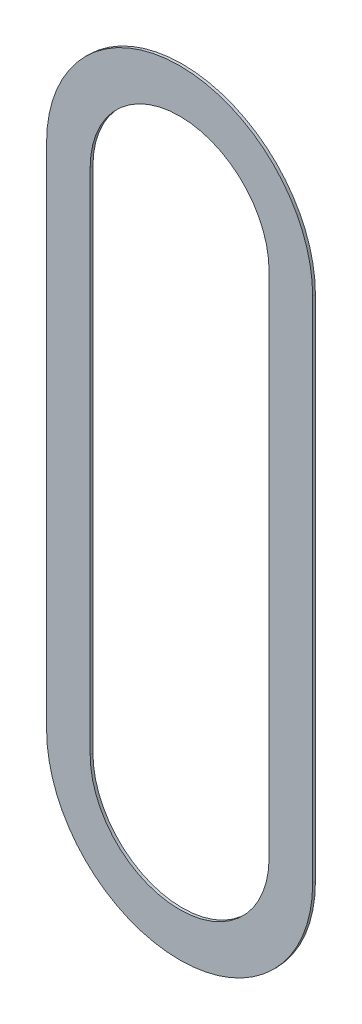
ISO-10303-21;
HEADER;
FILE_DESCRIPTION(('STEP AP214'),'2;1');
FILE_NAME('part.step','',(''),(''),'','','');
FILE_SCHEMA(('AUTOMOTIVE_DESIGN { 1 0 10303 214 1 1 1 1 }'));
ENDSEC;
DATA;
#1=APPLICATION_CONTEXT('core data for automotive mechanical design processes');
#2=APPLICATION_PROTOCOL_DEFINITION('international standard','automotive_design',2000,#1);
#3=PRODUCT_CONTEXT('',#1,'mechanical');
#4=PRODUCT('Part','Part','',(#3));
#5=PRODUCT_RELATED_PRODUCT_CATEGORY('part','',(#4));
#6=PRODUCT_DEFINITION_FORMATION('','',#4);
#7=PRODUCT_DEFINITION_CONTEXT('part definition',#1,'design');
#8=PRODUCT_DEFINITION('design','',#6,#7);
#9=PRODUCT_DEFINITION_SHAPE('','',#8);
#10=(LENGTH_UNIT() NAMED_UNIT(*) SI_UNIT(.MILLI.,.METRE.));
#11=(NAMED_UNIT(*) PLANE_ANGLE_UNIT() SI_UNIT($,.RADIAN.));
#12=(NAMED_UNIT(*) SI_UNIT($,.STERADIAN.) SOLID_ANGLE_UNIT());
#13=UNCERTAINTY_MEASURE_WITH_UNIT(LENGTH_MEASURE(1.E-05),#10,'distance_accuracy_value','');
#14=(GEOMETRIC_REPRESENTATION_CONTEXT(3) GLOBAL_UNCERTAINTY_ASSIGNED_CONTEXT((#13)) GLOBAL_UNIT_ASSIGNED_CONTEXT((#10,
#11,#12)) REPRESENTATION_CONTEXT('',''));
#15=CARTESIAN_POINT('',(0.,0.,0.));
#16=DIRECTION('',(0.,0.,1.));
#17=DIRECTION('',(1.,0.,0.));
#18=AXIS2_PLACEMENT_3D('',#15,#16,#17);
#19=CARTESIAN_POINT('',(16.5805785526266,2.38584342868797,0.));
#20=DIRECTION('',(0.,0.,-1.));
#21=DIRECTION('',(0.,-1.,0.));
#22=AXIS2_PLACEMENT_3D('',#19,#20,#21);
#23=PLANE('',#22);
#24=CARTESIAN_POINT('',(16.5805785526263,1.9248653543712,0.));
#25=DIRECTION('',(0.,0.,1.));
#26=DIRECTION('',(1.,0.,0.));
#27=AXIS2_PLACEMENT_3D('',#24,#25,#26);
#28=CIRCLE('',#27,0.162223011351486);
#29=CARTESIAN_POINT('',(16.4183555412749,1.9248653543712,0.));
#30=VERTEX_POINT('',#29);
#31=CARTESIAN_POINT('',(16.7428015639778,1.9248653543712,0.));
#32=VERTEX_POINT('',#31);
#33=EDGE_CURVE('E82',#30,#32,#28,.T.);
#34=ORIENTED_EDGE('',*,*,#33,.F.);
#35=DIRECTION('',(0.,-1.,0.));
#36=VECTOR('',#35,1.);
#37=CARTESIAN_POINT('',(16.4183555412749,1.9248653543712,0.));
#38=LINE('',#37,#36);
#39=CARTESIAN_POINT('',(16.4183555412749,2.84682150300628,0.));
#40=VERTEX_POINT('',#39);
#41=EDGE_CURVE('E150',#40,#30,#38,.T.);
#42=ORIENTED_EDGE('',*,*,#41,.F.);
#43=CARTESIAN_POINT('',(16.5805785526263,2.84682150300628,0.));
#44=DIRECTION('',(0.,0.,1.));
#45=DIRECTION('',(-1.,0.,0.));
#46=AXIS2_PLACEMENT_3D('',#43,#44,#45);
#47=CIRCLE('',#46,0.162223011351486);
#48=CARTESIAN_POINT('',(16.7428015639778,2.84682150300628,0.));
#49=VERTEX_POINT('',#48);
#50=EDGE_CURVE('E131',#49,#40,#47,.T.);
#51=ORIENTED_EDGE('',*,*,#50,.F.);
#52=DIRECTION('',(0.,1.,0.));
#53=VECTOR('',#52,1.);
#54=CARTESIAN_POINT('',(16.7428015639778,2.84682150300628,0.));
#55=LINE('',#54,#53);
#56=EDGE_CURVE('E117',#32,#49,#55,.T.);
#57=ORIENTED_EDGE('',*,*,#56,.F.);
#58=EDGE_LOOP('',(#34,#42,#51,#57));
#59=FACE_BOUND('',#58,.T.);
#60=CARTESIAN_POINT('',(16.5805785526269,1.9248653543712,0.));
#61=DIRECTION('',(0.,0.,-1.));
#62=DIRECTION('',(1.,1.64619282766669E-12,0.));
#63=AXIS2_PLACEMENT_3D('',#60,#61,#62);
#64=CIRCLE('',#63,0.241273245991853);
#65=CARTESIAN_POINT('',(16.8218517986187,1.92486535437159,0.));
#66=VERTEX_POINT('',#65);
#67=CARTESIAN_POINT('',(16.339305306635,1.9248653543708,0.));
#68=VERTEX_POINT('',#67);
#69=EDGE_CURVE('E21',#66,#68,#64,.T.);
#70=ORIENTED_EDGE('',*,*,#69,.F.);
#71=DIRECTION('',(2.23018529097051E-12,-1.,0.));
#72=VECTOR('',#71,1.);
#73=CARTESIAN_POINT('',(16.8218517986167,2.84682150300668,0.));
#74=LINE('',#73,#72);
#75=CARTESIAN_POINT('',(16.8218517986167,2.84682150300668,0.));
#76=VERTEX_POINT('',#75);
#77=EDGE_CURVE('E151',#76,#66,#74,.T.);
#78=ORIENTED_EDGE('',*,*,#77,.F.);
#79=CARTESIAN_POINT('',(16.5805785526263,2.84682150300628,0.));
#80=DIRECTION('',(0.,0.,-1.));
#81=DIRECTION('',(-1.,1.64734320701166E-12,0.));
#82=AXIS2_PLACEMENT_3D('',#79,#80,#81);
#83=CIRCLE('',#82,0.241273245990319);
#84=CARTESIAN_POINT('',(16.339305306636,2.84682150300668,0.));
#85=VERTEX_POINT('',#84);
#86=EDGE_CURVE('E142',#85,#76,#83,.T.);
#87=ORIENTED_EDGE('',*,*,#86,.F.);
#88=DIRECTION('',(1.67143476450706E-12,1.,0.));
#89=VECTOR('',#88,1.);
#90=CARTESIAN_POINT('',(16.3393053066345,1.92486535437159,0.));
#91=LINE('',#90,#89);
#92=EDGE_CURVE('E158',#68,#85,#91,.T.);
#93=ORIENTED_EDGE('',*,*,#92,.F.);
#94=EDGE_LOOP('',(#70,#78,#87,#93));
#95=FACE_BOUND('',#94,.T.);
#96=ADVANCED_FACE('F17',(#59,#95),#23,.F.);
#97=CARTESIAN_POINT('',(16.5805785526266,2.38584342868797,-0.005));
#98=DIRECTION('',(0.,0.,-1.));
#99=DIRECTION('',(0.,-1.,0.));
#100=AXIS2_PLACEMENT_3D('',#97,#98,#99);
#101=PLANE('',#100);
#102=CARTESIAN_POINT('',(16.5805785526263,1.9248653543712,-0.005));
#103=DIRECTION('',(0.,0.,1.));
#104=DIRECTION('',(1.,0.,0.));
#105=AXIS2_PLACEMENT_3D('',#102,#103,#104);
#106=CIRCLE('',#105,0.162223011351486);
#107=CARTESIAN_POINT('',(16.4183555412749,1.9248653543712,-0.005));
#108=VERTEX_POINT('',#107);
#109=CARTESIAN_POINT('',(16.7428015639778,1.9248653543712,-0.005));
#110=VERTEX_POINT('',#109);
#111=EDGE_CURVE('E70',#108,#110,#106,.T.);
#112=ORIENTED_EDGE('',*,*,#111,.T.);
#113=DIRECTION('',(0.,1.,0.));
#114=VECTOR('',#113,1.);
#115=CARTESIAN_POINT('',(16.7428015639778,2.84682150300628,-0.005));
#116=LINE('',#115,#114);
#117=CARTESIAN_POINT('',(16.7428015639778,2.84682150300628,-0.005));
#118=VERTEX_POINT('',#117);
#119=EDGE_CURVE('E107',#110,#118,#116,.T.);
#120=ORIENTED_EDGE('',*,*,#119,.T.);
#121=CARTESIAN_POINT('',(16.5805785526263,2.84682150300628,-0.005));
#122=DIRECTION('',(0.,0.,1.));
#123=DIRECTION('',(-1.,0.,0.));
#124=AXIS2_PLACEMENT_3D('',#121,#122,#123);
#125=CIRCLE('',#124,0.162223011351486);
#126=CARTESIAN_POINT('',(16.4183555412749,2.84682150300628,-0.005));
#127=VERTEX_POINT('',#126);
#128=EDGE_CURVE('E111',#118,#127,#125,.T.);
#129=ORIENTED_EDGE('',*,*,#128,.T.);
#130=DIRECTION('',(0.,-1.,0.));
#131=VECTOR('',#130,1.);
#132=CARTESIAN_POINT('',(16.4183555412749,1.9248653543712,-0.005));
#133=LINE('',#132,#131);
#134=EDGE_CURVE('E140',#127,#108,#133,.T.);
#135=ORIENTED_EDGE('',*,*,#134,.T.);
#136=EDGE_LOOP('',(#112,#120,#129,#135));
#137=FACE_BOUND('',#136,.T.);
#138=CARTESIAN_POINT('',(16.5805785526269,1.9248653543712,-0.005));
#139=DIRECTION('',(0.,0.,-1.));
#140=DIRECTION('',(1.,1.64619282766669E-12,0.));
#141=AXIS2_PLACEMENT_3D('',#138,#139,#140);
#142=CIRCLE('',#141,0.241273245991853);
#143=CARTESIAN_POINT('',(16.8218517986187,1.92486535437159,-0.005));
#144=VERTEX_POINT('',#143);
#145=CARTESIAN_POINT('',(16.339305306635,1.9248653543708,-0.005));
#146=VERTEX_POINT('',#145);
#147=EDGE_CURVE('E11',#144,#146,#142,.T.);
#148=ORIENTED_EDGE('',*,*,#147,.T.);
#149=DIRECTION('',(1.67143476450706E-12,1.,0.));
#150=VECTOR('',#149,1.);
#151=CARTESIAN_POINT('',(16.3393053066345,1.92486535437159,-0.005));
#152=LINE('',#151,#150);
#153=CARTESIAN_POINT('',(16.339305306636,2.84682150300668,-0.005));
#154=VERTEX_POINT('',#153);
#155=EDGE_CURVE('E155',#146,#154,#152,.T.);
#156=ORIENTED_EDGE('',*,*,#155,.T.);
#157=CARTESIAN_POINT('',(16.5805785526263,2.84682150300628,-0.005));
#158=DIRECTION('',(0.,0.,-1.));
#159=DIRECTION('',(-1.,1.64734320701166E-12,0.));
#160=AXIS2_PLACEMENT_3D('',#157,#158,#159);
#161=CIRCLE('',#160,0.241273245990319);
#162=CARTESIAN_POINT('',(16.8218517986167,2.84682150300668,-0.005));
#163=VERTEX_POINT('',#162);
#164=EDGE_CURVE('E144',#154,#163,#161,.T.);
#165=ORIENTED_EDGE('',*,*,#164,.T.);
#166=DIRECTION('',(2.23018529097051E-12,-1.,0.));
#167=VECTOR('',#166,1.);
#168=CARTESIAN_POINT('',(16.8218517986167,2.84682150300668,-0.005));
#169=LINE('',#168,#167);
#170=EDGE_CURVE('E185',#163,#144,#169,.T.);
#171=ORIENTED_EDGE('',*,*,#170,.T.);
#172=EDGE_LOOP('',(#148,#156,#165,#171));
#173=FACE_BOUND('',#172,.T.);
#174=ADVANCED_FACE('F109',(#137,#173),#101,.T.);
#175=CARTESIAN_POINT('',(16.5805785526269,1.9248653543712,0.));
#176=DIRECTION('',(0.,0.,-1.));
#177=DIRECTION('',(1.,1.64619282766669E-12,0.));
#178=AXIS2_PLACEMENT_3D('',#175,#176,#177);
#179=CYLINDRICAL_SURFACE('',#178,0.241273245991853);
#180=ORIENTED_EDGE('',*,*,#69,.T.);
#181=DIRECTION('',(0.,0.,-1.));
#182=VECTOR('',#181,1.);
#183=CARTESIAN_POINT('',(16.339305306635,1.9248653543708,0.));
#184=LINE('',#183,#182);
#185=EDGE_CURVE('E157',#68,#146,#184,.T.);
#186=ORIENTED_EDGE('',*,*,#185,.T.);
#187=ORIENTED_EDGE('',*,*,#147,.F.);
#188=DIRECTION('',(0.,0.,-1.));
#189=VECTOR('',#188,1.);
#190=CARTESIAN_POINT('',(16.8218517986187,1.92486535437159,0.));
#191=LINE('',#190,#189);
#192=EDGE_CURVE('E154',#66,#144,#191,.T.);
#193=ORIENTED_EDGE('',*,*,#192,.F.);
#194=EDGE_LOOP('',(#180,#186,#187,#193));
#195=FACE_BOUND('',#194,.T.);
#196=ADVANCED_FACE('F211',(#195),#179,.T.);
#197=CARTESIAN_POINT('',(16.3393053066345,1.92486535437159,0.));
#198=DIRECTION('',(-1.,1.67143476450706E-12,0.));
#199=DIRECTION('',(0.,0.,1.));
#200=AXIS2_PLACEMENT_3D('',#197,#198,#199);
#201=PLANE('',#200);
#202=ORIENTED_EDGE('',*,*,#92,.T.);
#203=DIRECTION('',(0.,0.,-1.));
#204=VECTOR('',#203,1.);
#205=CARTESIAN_POINT('',(16.339305306636,2.84682150300668,0.));
#206=LINE('',#205,#204);
#207=EDGE_CURVE('E166',#85,#154,#206,.T.);
#208=ORIENTED_EDGE('',*,*,#207,.T.);
#209=ORIENTED_EDGE('',*,*,#155,.F.);
#210=ORIENTED_EDGE('',*,*,#185,.F.);
#211=EDGE_LOOP('',(#202,#208,#209,#210));
#212=FACE_BOUND('',#211,.T.);
#213=ADVANCED_FACE('F19',(#212),#201,.T.);
#214=CARTESIAN_POINT('',(16.5805785526263,2.84682150300628,0.));
#215=DIRECTION('',(0.,0.,-1.));
#216=DIRECTION('',(-1.,1.64734320701166E-12,0.));
#217=AXIS2_PLACEMENT_3D('',#214,#215,#216);
#218=CYLINDRICAL_SURFACE('',#217,0.241273245990319);
#219=ORIENTED_EDGE('',*,*,#86,.T.);
#220=DIRECTION('',(0.,0.,-1.));
#221=VECTOR('',#220,1.);
#222=CARTESIAN_POINT('',(16.8218517986167,2.84682150300668,0.));
#223=LINE('',#222,#221);
#224=EDGE_CURVE('E145',#76,#163,#223,.T.);
#225=ORIENTED_EDGE('',*,*,#224,.T.);
#226=ORIENTED_EDGE('',*,*,#164,.F.);
#227=ORIENTED_EDGE('',*,*,#207,.F.);
#228=EDGE_LOOP('',(#219,#225,#226,#227));
#229=FACE_BOUND('',#228,.T.);
#230=ADVANCED_FACE('F218',(#229),#218,.T.);
#231=CARTESIAN_POINT('',(16.8218517986167,2.84682150300668,0.));
#232=DIRECTION('',(1.,2.23018529097051E-12,0.));
#233=DIRECTION('',(-2.23018529097051E-12,1.,0.));
#234=AXIS2_PLACEMENT_3D('',#231,#232,#233);
#235=PLANE('',#234);
#236=ORIENTED_EDGE('',*,*,#77,.T.);
#237=ORIENTED_EDGE('',*,*,#192,.T.);
#238=ORIENTED_EDGE('',*,*,#170,.F.);
#239=ORIENTED_EDGE('',*,*,#224,.F.);
#240=EDGE_LOOP('',(#236,#237,#238,#239));
#241=FACE_BOUND('',#240,.T.);
#242=ADVANCED_FACE('F215',(#241),#235,.T.);
#243=CARTESIAN_POINT('',(16.5805785526263,1.9248653543712,0.));
#244=DIRECTION('',(0.,0.,-1.));
#245=DIRECTION('',(1.,0.,0.));
#246=AXIS2_PLACEMENT_3D('',#243,#244,#245);
#247=CYLINDRICAL_SURFACE('',#246,0.162223011351486);
#248=ORIENTED_EDGE('',*,*,#33,.T.);
#249=DIRECTION('',(0.,0.,-1.));
#250=VECTOR('',#249,1.);
#251=CARTESIAN_POINT('',(16.7428015639778,1.9248653543712,0.));
#252=LINE('',#251,#250);
#253=EDGE_CURVE('E116',#32,#110,#252,.T.);
#254=ORIENTED_EDGE('',*,*,#253,.T.);
#255=ORIENTED_EDGE('',*,*,#111,.F.);
#256=DIRECTION('',(0.,0.,-1.));
#257=VECTOR('',#256,1.);
#258=CARTESIAN_POINT('',(16.4183555412749,1.9248653543712,0.));
#259=LINE('',#258,#257);
#260=EDGE_CURVE('E146',#30,#108,#259,.T.);
#261=ORIENTED_EDGE('',*,*,#260,.F.);
#262=EDGE_LOOP('',(#248,#254,#255,#261));
#263=FACE_BOUND('',#262,.T.);
#264=ADVANCED_FACE('F203',(#263),#247,.F.);
#265=CARTESIAN_POINT('',(16.7428015639778,1.9248653543712,0.));
#266=DIRECTION('',(-1.,0.,0.));
#267=DIRECTION('',(0.,0.,1.));
#268=AXIS2_PLACEMENT_3D('',#265,#266,#267);
#269=PLANE('',#268);
#270=ORIENTED_EDGE('',*,*,#56,.T.);
#271=DIRECTION('',(0.,0.,-1.));
#272=VECTOR('',#271,1.);
#273=CARTESIAN_POINT('',(16.7428015639778,2.84682150300628,0.));
#274=LINE('',#273,#272);
#275=EDGE_CURVE('E120',#49,#118,#274,.T.);
#276=ORIENTED_EDGE('',*,*,#275,.T.);
#277=ORIENTED_EDGE('',*,*,#119,.F.);
#278=ORIENTED_EDGE('',*,*,#253,.F.);
#279=EDGE_LOOP('',(#270,#276,#277,#278));
#280=FACE_BOUND('',#279,.T.);
#281=ADVANCED_FACE('F121',(#280),#269,.T.);
#282=CARTESIAN_POINT('',(16.5805785526263,2.84682150300628,0.));
#283=DIRECTION('',(0.,0.,-1.));
#284=DIRECTION('',(-1.,0.,0.));
#285=AXIS2_PLACEMENT_3D('',#282,#283,#284);
#286=CYLINDRICAL_SURFACE('',#285,0.162223011351486);
#287=ORIENTED_EDGE('',*,*,#50,.T.);
#288=DIRECTION('',(0.,0.,-1.));
#289=VECTOR('',#288,1.);
#290=CARTESIAN_POINT('',(16.4183555412749,2.84682150300628,0.));
#291=LINE('',#290,#289);
#292=EDGE_CURVE('E128',#40,#127,#291,.T.);
#293=ORIENTED_EDGE('',*,*,#292,.T.);
#294=ORIENTED_EDGE('',*,*,#128,.F.);
#295=ORIENTED_EDGE('',*,*,#275,.F.);
#296=EDGE_LOOP('',(#287,#293,#294,#295));
#297=FACE_BOUND('',#296,.T.);
#298=ADVANCED_FACE('F126',(#297),#286,.F.);
#299=CARTESIAN_POINT('',(16.4183555412749,2.84682150300628,0.));
#300=DIRECTION('',(1.,0.,0.));
#301=DIRECTION('',(0.,1.,0.));
#302=AXIS2_PLACEMENT_3D('',#299,#300,#301);
#303=PLANE('',#302);
#304=ORIENTED_EDGE('',*,*,#41,.T.);
#305=ORIENTED_EDGE('',*,*,#260,.T.);
#306=ORIENTED_EDGE('',*,*,#134,.F.);
#307=ORIENTED_EDGE('',*,*,#292,.F.);
#308=EDGE_LOOP('',(#304,#305,#306,#307));
#309=FACE_BOUND('',#308,.T.);
#310=ADVANCED_FACE('F202',(#309),#303,.T.);
#311=CLOSED_SHELL('',(#96,#174,#196,#213,#230,#242,#264,#281,#298,#310));
#312=MANIFOLD_SOLID_BREP('B1',#311);
#313=ADVANCED_BREP_SHAPE_REPRESENTATION('',(#18,#312),#14);
#314=SHAPE_DEFINITION_REPRESENTATION(#9,#313);
ENDSEC;
END-ISO-10303-21;
